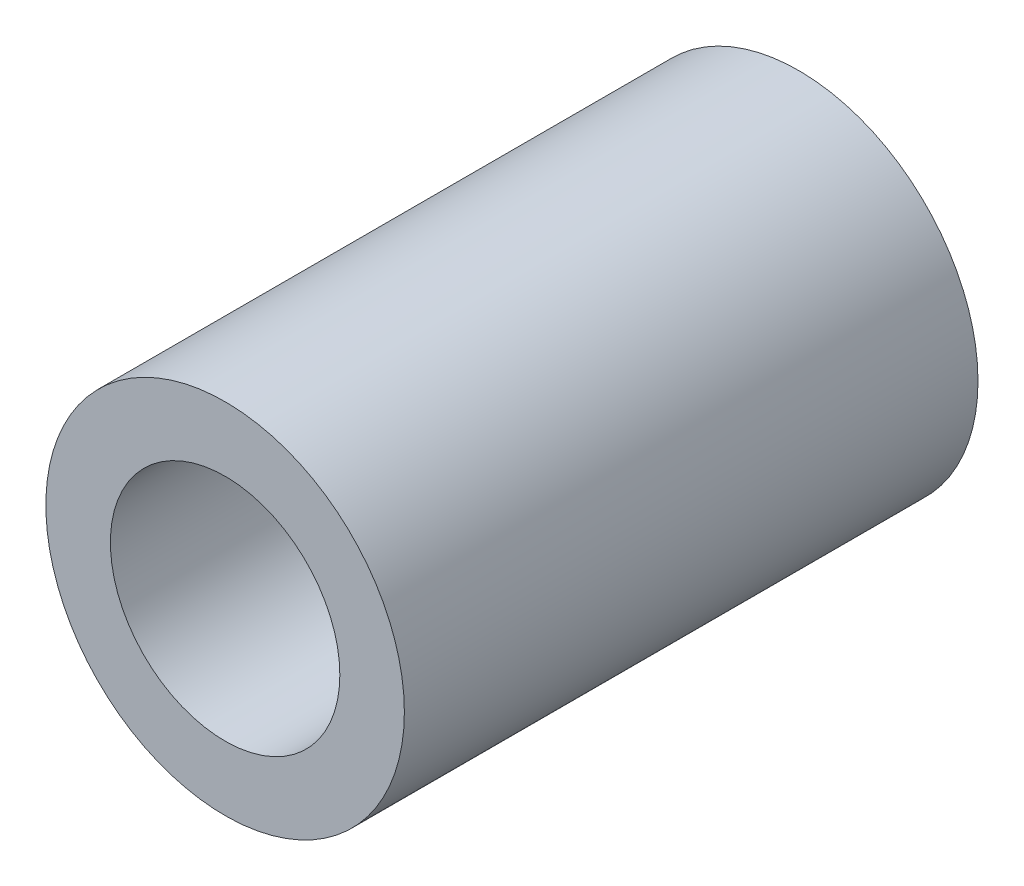
ISO-10303-21;
HEADER;
FILE_DESCRIPTION(('STEP AP214'),'2;1');
FILE_NAME('part.step','',(''),(''),'','','');
FILE_SCHEMA(('AUTOMOTIVE_DESIGN { 1 0 10303 214 1 1 1 1 }'));
ENDSEC;
DATA;
#1=APPLICATION_CONTEXT('core data for automotive mechanical design processes');
#2=APPLICATION_PROTOCOL_DEFINITION('international standard','automotive_design',2000,#1);
#3=PRODUCT_CONTEXT('',#1,'mechanical');
#4=PRODUCT('Part','Part','',(#3));
#5=PRODUCT_RELATED_PRODUCT_CATEGORY('part','',(#4));
#6=PRODUCT_DEFINITION_FORMATION('','',#4);
#7=PRODUCT_DEFINITION_CONTEXT('part definition',#1,'design');
#8=PRODUCT_DEFINITION('design','',#6,#7);
#9=PRODUCT_DEFINITION_SHAPE('','',#8);
#10=(LENGTH_UNIT() NAMED_UNIT(*) SI_UNIT(.MILLI.,.METRE.));
#11=(NAMED_UNIT(*) PLANE_ANGLE_UNIT() SI_UNIT($,.RADIAN.));
#12=(NAMED_UNIT(*) SI_UNIT($,.STERADIAN.) SOLID_ANGLE_UNIT());
#13=UNCERTAINTY_MEASURE_WITH_UNIT(LENGTH_MEASURE(1.E-05),#10,'distance_accuracy_value','');
#14=(GEOMETRIC_REPRESENTATION_CONTEXT(3) GLOBAL_UNCERTAINTY_ASSIGNED_CONTEXT((#13)) GLOBAL_UNIT_ASSIGNED_CONTEXT((#10,
#11,#12)) REPRESENTATION_CONTEXT('',''));
#15=CARTESIAN_POINT('',(0.,0.,0.));
#16=DIRECTION('',(0.,0.,1.));
#17=DIRECTION('',(1.,0.,0.));
#18=AXIS2_PLACEMENT_3D('',#15,#16,#17);
#19=CARTESIAN_POINT('',(0.,0.,8.));
#20=DIRECTION('',(0.,0.,1.));
#21=DIRECTION('',(1.,0.,0.));
#22=AXIS2_PLACEMENT_3D('',#19,#20,#21);
#23=PLANE('',#22);
#24=CARTESIAN_POINT('',(0.,0.,8.));
#25=DIRECTION('',(0.,0.,1.));
#26=DIRECTION('',(1.,0.,0.));
#27=AXIS2_PLACEMENT_3D('',#24,#25,#26);
#28=CIRCLE('',#27,2.5);
#29=CARTESIAN_POINT('',(2.5,0.,8.));
#30=VERTEX_POINT('',#29);
#31=EDGE_CURVE('E10',#30,#30,#28,.T.);
#32=ORIENTED_EDGE('',*,*,#31,.T.);
#33=EDGE_LOOP('',(#32));
#34=FACE_BOUND('',#33,.T.);
#35=CARTESIAN_POINT('',(0.,0.,8.));
#36=DIRECTION('',(0.,0.,1.));
#37=DIRECTION('',(1.,0.,0.));
#38=AXIS2_PLACEMENT_3D('',#35,#36,#37);
#39=CIRCLE('',#38,1.6);
#40=CARTESIAN_POINT('',(1.6,0.,8.));
#41=VERTEX_POINT('',#40);
#42=EDGE_CURVE('E54',#41,#41,#39,.T.);
#43=ORIENTED_EDGE('',*,*,#42,.F.);
#44=EDGE_LOOP('',(#43));
#45=FACE_BOUND('',#44,.T.);
#46=ADVANCED_FACE('F41',(#34,#45),#23,.T.);
#47=CARTESIAN_POINT('',(0.,0.,0.));
#48=DIRECTION('',(0.,0.,1.));
#49=DIRECTION('',(1.,0.,0.));
#50=AXIS2_PLACEMENT_3D('',#47,#48,#49);
#51=PLANE('',#50);
#52=CARTESIAN_POINT('',(0.,0.,0.));
#53=DIRECTION('',(0.,0.,1.));
#54=DIRECTION('',(1.,0.,0.));
#55=AXIS2_PLACEMENT_3D('',#52,#53,#54);
#56=CIRCLE('',#55,2.5);
#57=CARTESIAN_POINT('',(2.5,0.,0.));
#58=VERTEX_POINT('',#57);
#59=EDGE_CURVE('E45',#58,#58,#56,.T.);
#60=ORIENTED_EDGE('',*,*,#59,.F.);
#61=EDGE_LOOP('',(#60));
#62=FACE_BOUND('',#61,.T.);
#63=CARTESIAN_POINT('',(0.,0.,0.));
#64=DIRECTION('',(0.,0.,1.));
#65=DIRECTION('',(1.,0.,0.));
#66=AXIS2_PLACEMENT_3D('',#63,#64,#65);
#67=CIRCLE('',#66,1.6);
#68=CARTESIAN_POINT('',(1.6,0.,0.));
#69=VERTEX_POINT('',#68);
#70=EDGE_CURVE('E56',#69,#69,#67,.T.);
#71=ORIENTED_EDGE('',*,*,#70,.T.);
#72=EDGE_LOOP('',(#71));
#73=FACE_BOUND('',#72,.T.);
#74=ADVANCED_FACE('F68',(#62,#73),#51,.F.);
#75=CARTESIAN_POINT('',(0.,0.,8.));
#76=DIRECTION('',(0.,0.,-1.));
#77=DIRECTION('',(-1.,0.,0.));
#78=AXIS2_PLACEMENT_3D('',#75,#76,#77);
#79=CYLINDRICAL_SURFACE('',#78,2.5);
#80=ORIENTED_EDGE('',*,*,#31,.F.);
#81=EDGE_LOOP('',(#80));
#82=FACE_BOUND('',#81,.T.);
#83=ORIENTED_EDGE('',*,*,#59,.T.);
#84=EDGE_LOOP('',(#83));
#85=FACE_BOUND('',#84,.T.);
#86=ADVANCED_FACE('F43',(#82,#85),#79,.T.);
#87=CARTESIAN_POINT('',(0.,0.,8.));
#88=DIRECTION('',(0.,0.,-1.));
#89=DIRECTION('',(-1.,0.,0.));
#90=AXIS2_PLACEMENT_3D('',#87,#88,#89);
#91=CYLINDRICAL_SURFACE('',#90,1.6);
#92=ORIENTED_EDGE('',*,*,#42,.T.);
#93=EDGE_LOOP('',(#92));
#94=FACE_BOUND('',#93,.T.);
#95=ORIENTED_EDGE('',*,*,#70,.F.);
#96=EDGE_LOOP('',(#95));
#97=FACE_BOUND('',#96,.T.);
#98=ADVANCED_FACE('F64',(#94,#97),#91,.F.);
#99=CLOSED_SHELL('',(#46,#74,#86,#98));
#100=MANIFOLD_SOLID_BREP('B2',#99);
#101=ADVANCED_BREP_SHAPE_REPRESENTATION('',(#18,#100),#14);
#102=SHAPE_DEFINITION_REPRESENTATION(#9,#101);
ENDSEC;
END-ISO-10303-21;
